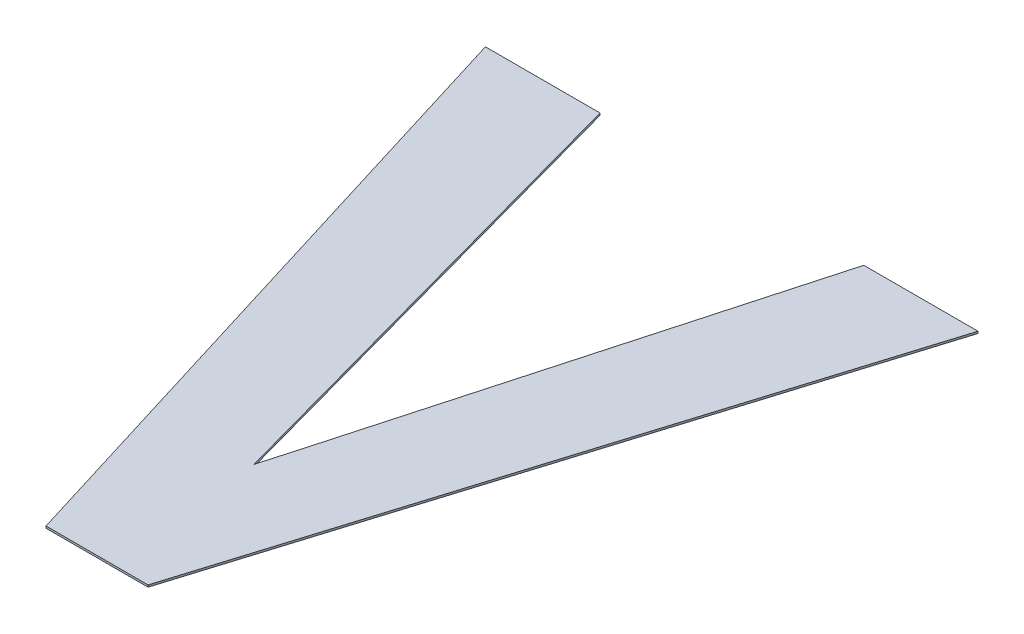
ISO-10303-21;
HEADER;
FILE_DESCRIPTION(('STEP AP214'),'2;1');
FILE_NAME('part.step','',(''),(''),'','','');
FILE_SCHEMA(('AUTOMOTIVE_DESIGN { 1 0 10303 214 1 1 1 1 }'));
ENDSEC;
DATA;
#1=APPLICATION_CONTEXT('core data for automotive mechanical design processes');
#2=APPLICATION_PROTOCOL_DEFINITION('international standard','automotive_design',2000,#1);
#3=PRODUCT_CONTEXT('',#1,'mechanical');
#4=PRODUCT('Part','Part','',(#3));
#5=PRODUCT_RELATED_PRODUCT_CATEGORY('part','',(#4));
#6=PRODUCT_DEFINITION_FORMATION('','',#4);
#7=PRODUCT_DEFINITION_CONTEXT('part definition',#1,'design');
#8=PRODUCT_DEFINITION('design','',#6,#7);
#9=PRODUCT_DEFINITION_SHAPE('','',#8);
#10=(LENGTH_UNIT() NAMED_UNIT(*) SI_UNIT(.MILLI.,.METRE.));
#11=(NAMED_UNIT(*) PLANE_ANGLE_UNIT() SI_UNIT($,.RADIAN.));
#12=(NAMED_UNIT(*) SI_UNIT($,.STERADIAN.) SOLID_ANGLE_UNIT());
#13=UNCERTAINTY_MEASURE_WITH_UNIT(LENGTH_MEASURE(1.E-05),#10,'distance_accuracy_value','');
#14=(GEOMETRIC_REPRESENTATION_CONTEXT(3) GLOBAL_UNCERTAINTY_ASSIGNED_CONTEXT((#13)) GLOBAL_UNIT_ASSIGNED_CONTEXT((#10,
#11,#12)) REPRESENTATION_CONTEXT('',''));
#15=CARTESIAN_POINT('',(0.,0.,0.));
#16=DIRECTION('',(0.,0.,1.));
#17=DIRECTION('',(1.,0.,0.));
#18=AXIS2_PLACEMENT_3D('',#15,#16,#17);
#19=CARTESIAN_POINT('',(0.,6.,0.));
#20=DIRECTION('',(0.,1.,0.));
#21=DIRECTION('',(1.,0.,0.));
#22=AXIS2_PLACEMENT_3D('',#19,#20,#21);
#23=PLANE('',#22);
#24=DIRECTION('',(0.294085848837945,0.,0.95577900872182));
#25=VECTOR('',#24,1.);
#26=CARTESIAN_POINT('',(4.393508791849,6.,0.859042110188));
#27=LINE('',#26,#25);
#28=CARTESIAN_POINT('',(4.393508791849,6.,0.859042110188));
#29=VERTEX_POINT('',#28);
#30=CARTESIAN_POINT('',(5.370431868772,6.,4.034042110188));
#31=VERTEX_POINT('',#30);
#32=EDGE_CURVE('E154',#29,#31,#27,.T.);
#33=ORIENTED_EDGE('',*,*,#32,.F.);
#34=DIRECTION('',(-1.,0.,0.));
#35=VECTOR('',#34,1.);
#36=CARTESIAN_POINT('',(4.967257265597,6.,0.859042110188));
#37=LINE('',#36,#35);
#38=CARTESIAN_POINT('',(4.967257265597,6.,0.859042110188));
#39=VERTEX_POINT('',#38);
#40=EDGE_CURVE('E27',#39,#29,#37,.T.);
#41=ORIENTED_EDGE('',*,*,#40,.F.);
#42=DIRECTION('',(-0.265011551126037,0.,-0.964245237359134));
#43=VECTOR('',#42,1.);
#44=CARTESIAN_POINT('',(5.571373057213,6.,3.057119033265));
#45=LINE('',#44,#43);
#46=CARTESIAN_POINT('',(5.571373057213,6.,3.057119033265));
#47=VERTEX_POINT('',#46);
#48=EDGE_CURVE('E170',#47,#39,#45,.T.);
#49=ORIENTED_EDGE('',*,*,#48,.F.);
#50=DIRECTION('',(-0.265613747619887,0.,-0.96407952839759));
#51=VECTOR('',#50,1.);
#52=CARTESIAN_POINT('',(5.623708222048,6.,3.247076298223));
#53=LINE('',#52,#51);
#54=CARTESIAN_POINT('',(5.623708222048,6.,3.247076298223));
#55=VERTEX_POINT('',#54);
#56=EDGE_CURVE('E113',#55,#47,#53,.T.);
#57=ORIENTED_EDGE('',*,*,#56,.F.);
#58=DIRECTION('',(-0.272152670482986,0.,0.96225408492195));
#59=VECTOR('',#58,1.);
#60=CARTESIAN_POINT('',(5.677981726322,6.,3.055180693827));
#61=LINE('',#60,#59);
#62=CARTESIAN_POINT('',(5.677981726322,6.,3.055180693827));
#63=VERTEX_POINT('',#62);
#64=EDGE_CURVE('E105',#63,#55,#61,.T.);
#65=ORIENTED_EDGE('',*,*,#64,.F.);
#66=DIRECTION('',(-0.267073532320139,0.,0.9636761532455));
#67=VECTOR('',#66,1.);
#68=CARTESIAN_POINT('',(6.28662030996,6.,0.859042110188));
#69=LINE('',#68,#67);
#70=CARTESIAN_POINT('',(6.28662030996,6.,0.859042110188));
#71=VERTEX_POINT('',#70);
#72=EDGE_CURVE('E109',#71,#63,#69,.T.);
#73=ORIENTED_EDGE('',*,*,#72,.F.);
#74=DIRECTION('',(-1.,0.,0.));
#75=VECTOR('',#74,1.);
#76=CARTESIAN_POINT('',(6.857784331124,6.,0.859042110188));
#77=LINE('',#76,#75);
#78=CARTESIAN_POINT('',(6.857784331124,6.,0.859042110188));
#79=VERTEX_POINT('',#78);
#80=EDGE_CURVE('E162',#79,#71,#77,.T.);
#81=ORIENTED_EDGE('',*,*,#80,.F.);
#82=DIRECTION('',(0.294085848837945,0.,-0.95577900872182));
#83=VECTOR('',#82,1.);
#84=CARTESIAN_POINT('',(5.880861254201,6.,4.034042110188));
#85=LINE('',#84,#83);
#86=CARTESIAN_POINT('',(5.880861254201,6.,4.034042110188));
#87=VERTEX_POINT('',#86);
#88=EDGE_CURVE('E174',#87,#79,#85,.T.);
#89=ORIENTED_EDGE('',*,*,#88,.F.);
#90=DIRECTION('',(1.,0.,0.));
#91=VECTOR('',#90,1.);
#92=CARTESIAN_POINT('',(5.370431868772,6.,4.034042110188));
#93=LINE('',#92,#91);
#94=EDGE_CURVE('E148',#31,#87,#93,.T.);
#95=ORIENTED_EDGE('',*,*,#94,.F.);
#96=EDGE_LOOP('',(#33,#41,#49,#57,#65,#73,#81,#89,#95));
#97=FACE_BOUND('',#96,.T.);
#98=ADVANCED_FACE('F16',(#97),#23,.F.);
#99=CARTESIAN_POINT('',(0.,6.01,0.));
#100=DIRECTION('',(0.,1.,0.));
#101=DIRECTION('',(1.,0.,0.));
#102=AXIS2_PLACEMENT_3D('',#99,#100,#101);
#103=PLANE('',#102);
#104=DIRECTION('',(0.294085848837945,0.,0.95577900872182));
#105=VECTOR('',#104,1.);
#106=CARTESIAN_POINT('',(4.393508791849,6.01,0.859042110188));
#107=LINE('',#106,#105);
#108=CARTESIAN_POINT('',(4.393508791849,6.01,0.859042110188));
#109=VERTEX_POINT('',#108);
#110=CARTESIAN_POINT('',(5.370431868772,6.01,4.034042110188));
#111=VERTEX_POINT('',#110);
#112=EDGE_CURVE('E149',#109,#111,#107,.T.);
#113=ORIENTED_EDGE('',*,*,#112,.T.);
#114=DIRECTION('',(1.,0.,0.));
#115=VECTOR('',#114,1.);
#116=CARTESIAN_POINT('',(5.370431868772,6.01,4.034042110188));
#117=LINE('',#116,#115);
#118=CARTESIAN_POINT('',(5.880861254201,6.01,4.034042110188));
#119=VERTEX_POINT('',#118);
#120=EDGE_CURVE('E159',#111,#119,#117,.T.);
#121=ORIENTED_EDGE('',*,*,#120,.T.);
#122=DIRECTION('',(0.294085848837945,0.,-0.95577900872182));
#123=VECTOR('',#122,1.);
#124=CARTESIAN_POINT('',(5.880861254201,6.01,4.034042110188));
#125=LINE('',#124,#123);
#126=CARTESIAN_POINT('',(6.857784331124,6.01,0.859042110188));
#127=VERTEX_POINT('',#126);
#128=EDGE_CURVE('E165',#119,#127,#125,.T.);
#129=ORIENTED_EDGE('',*,*,#128,.T.);
#130=DIRECTION('',(-1.,0.,0.));
#131=VECTOR('',#130,1.);
#132=CARTESIAN_POINT('',(6.857784331124,6.01,0.859042110188));
#133=LINE('',#132,#131);
#134=CARTESIAN_POINT('',(6.28662030996,6.01,0.859042110188));
#135=VERTEX_POINT('',#134);
#136=EDGE_CURVE('E134',#127,#135,#133,.T.);
#137=ORIENTED_EDGE('',*,*,#136,.T.);
#138=DIRECTION('',(-0.267073532320139,0.,0.9636761532455));
#139=VECTOR('',#138,1.);
#140=CARTESIAN_POINT('',(6.28662030996,6.01,0.859042110188));
#141=LINE('',#140,#139);
#142=CARTESIAN_POINT('',(5.677981726322,6.01,3.055180693827));
#143=VERTEX_POINT('',#142);
#144=EDGE_CURVE('E20',#135,#143,#141,.T.);
#145=ORIENTED_EDGE('',*,*,#144,.T.);
#146=DIRECTION('',(-0.272152670482986,0.,0.96225408492195));
#147=VECTOR('',#146,1.);
#148=CARTESIAN_POINT('',(5.677981726322,6.01,3.055180693827));
#149=LINE('',#148,#147);
#150=CARTESIAN_POINT('',(5.623708222048,6.01,3.247076298223));
#151=VERTEX_POINT('',#150);
#152=EDGE_CURVE('E124',#143,#151,#149,.T.);
#153=ORIENTED_EDGE('',*,*,#152,.T.);
#154=DIRECTION('',(-0.265613747619887,0.,-0.96407952839759));
#155=VECTOR('',#154,1.);
#156=CARTESIAN_POINT('',(5.623708222048,6.01,3.247076298223));
#157=LINE('',#156,#155);
#158=CARTESIAN_POINT('',(5.571373057213,6.01,3.057119033265));
#159=VERTEX_POINT('',#158);
#160=EDGE_CURVE('E166',#151,#159,#157,.T.);
#161=ORIENTED_EDGE('',*,*,#160,.T.);
#162=DIRECTION('',(-0.265011551126037,0.,-0.964245237359134));
#163=VECTOR('',#162,1.);
#164=CARTESIAN_POINT('',(5.571373057213,6.01,3.057119033265));
#165=LINE('',#164,#163);
#166=CARTESIAN_POINT('',(4.967257265597,6.01,0.859042110188));
#167=VERTEX_POINT('',#166);
#168=EDGE_CURVE('E144',#159,#167,#165,.T.);
#169=ORIENTED_EDGE('',*,*,#168,.T.);
#170=DIRECTION('',(-1.,0.,0.));
#171=VECTOR('',#170,1.);
#172=CARTESIAN_POINT('',(4.967257265597,6.01,0.859042110188));
#173=LINE('',#172,#171);
#174=EDGE_CURVE('E11',#167,#109,#173,.T.);
#175=ORIENTED_EDGE('',*,*,#174,.T.);
#176=EDGE_LOOP('',(#113,#121,#129,#137,#145,#153,#161,#169,#175));
#177=FACE_BOUND('',#176,.T.);
#178=ADVANCED_FACE('F18',(#177),#103,.T.);
#179=CARTESIAN_POINT('',(4.967257265597,6.01,0.859042110188));
#180=DIRECTION('',(0.,0.,1.));
#181=DIRECTION('',(1.,0.,0.));
#182=AXIS2_PLACEMENT_3D('',#179,#180,#181);
#183=PLANE('',#182);
#184=ORIENTED_EDGE('',*,*,#40,.T.);
#185=DIRECTION('',(0.,-1.,0.));
#186=VECTOR('',#185,1.);
#187=CARTESIAN_POINT('',(4.393508791849,6.01,0.859042110188));
#188=LINE('',#187,#186);
#189=EDGE_CURVE('E145',#109,#29,#188,.T.);
#190=ORIENTED_EDGE('',*,*,#189,.F.);
#191=ORIENTED_EDGE('',*,*,#174,.F.);
#192=DIRECTION('',(0.,-1.,0.));
#193=VECTOR('',#192,1.);
#194=CARTESIAN_POINT('',(4.967257265597,6.01,0.859042110188));
#195=LINE('',#194,#193);
#196=EDGE_CURVE('E210',#167,#39,#195,.T.);
#197=ORIENTED_EDGE('',*,*,#196,.T.);
#198=EDGE_LOOP('',(#184,#190,#191,#197));
#199=FACE_BOUND('',#198,.T.);
#200=ADVANCED_FACE('F248',(#199),#183,.F.);
#201=CARTESIAN_POINT('',(5.571373057213,6.01,3.057119033265));
#202=DIRECTION('',(-0.964245237359134,0.,0.265011551126037));
#203=DIRECTION('',(0.,1.,0.));
#204=AXIS2_PLACEMENT_3D('',#201,#202,#203);
#205=PLANE('',#204);
#206=ORIENTED_EDGE('',*,*,#48,.T.);
#207=ORIENTED_EDGE('',*,*,#196,.F.);
#208=ORIENTED_EDGE('',*,*,#168,.F.);
#209=DIRECTION('',(0.,-1.,0.));
#210=VECTOR('',#209,1.);
#211=CARTESIAN_POINT('',(5.571373057213,6.01,3.057119033265));
#212=LINE('',#211,#210);
#213=EDGE_CURVE('E171',#159,#47,#212,.T.);
#214=ORIENTED_EDGE('',*,*,#213,.T.);
#215=EDGE_LOOP('',(#206,#207,#208,#214));
#216=FACE_BOUND('',#215,.T.);
#217=ADVANCED_FACE('F251',(#216),#205,.F.);
#218=CARTESIAN_POINT('',(5.623708222048,6.01,3.247076298223));
#219=DIRECTION('',(-0.96407952839759,0.,0.265613747619887));
#220=DIRECTION('',(0.,1.,0.));
#221=AXIS2_PLACEMENT_3D('',#218,#219,#220);
#222=PLANE('',#221);
#223=ORIENTED_EDGE('',*,*,#56,.T.);
#224=ORIENTED_EDGE('',*,*,#213,.F.);
#225=ORIENTED_EDGE('',*,*,#160,.F.);
#226=DIRECTION('',(0.,-1.,0.));
#227=VECTOR('',#226,1.);
#228=CARTESIAN_POINT('',(5.623708222048,6.01,3.247076298223));
#229=LINE('',#228,#227);
#230=EDGE_CURVE('E118',#151,#55,#229,.T.);
#231=ORIENTED_EDGE('',*,*,#230,.T.);
#232=EDGE_LOOP('',(#223,#224,#225,#231));
#233=FACE_BOUND('',#232,.T.);
#234=ADVANCED_FACE('F307',(#233),#222,.F.);
#235=CARTESIAN_POINT('',(5.677981726322,6.01,3.055180693827));
#236=DIRECTION('',(0.96225408492195,0.,0.272152670482986));
#237=DIRECTION('',(0.,-1.,0.));
#238=AXIS2_PLACEMENT_3D('',#235,#236,#237);
#239=PLANE('',#238);
#240=ORIENTED_EDGE('',*,*,#64,.T.);
#241=ORIENTED_EDGE('',*,*,#230,.F.);
#242=ORIENTED_EDGE('',*,*,#152,.F.);
#243=DIRECTION('',(0.,-1.,0.));
#244=VECTOR('',#243,1.);
#245=CARTESIAN_POINT('',(5.677981726322,6.01,3.055180693827));
#246=LINE('',#245,#244);
#247=EDGE_CURVE('E121',#143,#63,#246,.T.);
#248=ORIENTED_EDGE('',*,*,#247,.T.);
#249=EDGE_LOOP('',(#240,#241,#242,#248));
#250=FACE_BOUND('',#249,.T.);
#251=ADVANCED_FACE('F122',(#250),#239,.F.);
#252=CARTESIAN_POINT('',(6.28662030996,6.01,0.859042110188));
#253=DIRECTION('',(0.9636761532455,0.,0.267073532320139));
#254=DIRECTION('',(0.,-1.,0.));
#255=AXIS2_PLACEMENT_3D('',#252,#253,#254);
#256=PLANE('',#255);
#257=ORIENTED_EDGE('',*,*,#72,.T.);
#258=ORIENTED_EDGE('',*,*,#247,.F.);
#259=ORIENTED_EDGE('',*,*,#144,.F.);
#260=DIRECTION('',(0.,-1.,0.));
#261=VECTOR('',#260,1.);
#262=CARTESIAN_POINT('',(6.28662030996,6.01,0.859042110188));
#263=LINE('',#262,#261);
#264=EDGE_CURVE('E131',#135,#71,#263,.T.);
#265=ORIENTED_EDGE('',*,*,#264,.T.);
#266=EDGE_LOOP('',(#257,#258,#259,#265));
#267=FACE_BOUND('',#266,.T.);
#268=ADVANCED_FACE('F129',(#267),#256,.F.);
#269=CARTESIAN_POINT('',(6.857784331124,6.01,0.859042110188));
#270=DIRECTION('',(0.,0.,1.));
#271=DIRECTION('',(1.,0.,0.));
#272=AXIS2_PLACEMENT_3D('',#269,#270,#271);
#273=PLANE('',#272);
#274=ORIENTED_EDGE('',*,*,#80,.T.);
#275=ORIENTED_EDGE('',*,*,#264,.F.);
#276=ORIENTED_EDGE('',*,*,#136,.F.);
#277=DIRECTION('',(0.,-1.,0.));
#278=VECTOR('',#277,1.);
#279=CARTESIAN_POINT('',(6.857784331124,6.01,0.859042110188));
#280=LINE('',#279,#278);
#281=EDGE_CURVE('E177',#127,#79,#280,.T.);
#282=ORIENTED_EDGE('',*,*,#281,.T.);
#283=EDGE_LOOP('',(#274,#275,#276,#282));
#284=FACE_BOUND('',#283,.T.);
#285=ADVANCED_FACE('F230',(#284),#273,.F.);
#286=CARTESIAN_POINT('',(5.880861254201,6.01,4.034042110188));
#287=DIRECTION('',(-0.95577900872182,0.,-0.294085848837945));
#288=DIRECTION('',(-0.294085848837945,0.,0.95577900872182));
#289=AXIS2_PLACEMENT_3D('',#286,#287,#288);
#290=PLANE('',#289);
#291=ORIENTED_EDGE('',*,*,#88,.T.);
#292=ORIENTED_EDGE('',*,*,#281,.F.);
#293=ORIENTED_EDGE('',*,*,#128,.F.);
#294=DIRECTION('',(0.,-1.,0.));
#295=VECTOR('',#294,1.);
#296=CARTESIAN_POINT('',(5.880861254201,6.01,4.034042110188));
#297=LINE('',#296,#295);
#298=EDGE_CURVE('E155',#119,#87,#297,.T.);
#299=ORIENTED_EDGE('',*,*,#298,.T.);
#300=EDGE_LOOP('',(#291,#292,#293,#299));
#301=FACE_BOUND('',#300,.T.);
#302=ADVANCED_FACE('F228',(#301),#290,.F.);
#303=CARTESIAN_POINT('',(5.370431868772,6.01,4.034042110188));
#304=DIRECTION('',(0.,0.,-1.));
#305=DIRECTION('',(0.,-1.,0.));
#306=AXIS2_PLACEMENT_3D('',#303,#304,#305);
#307=PLANE('',#306);
#308=ORIENTED_EDGE('',*,*,#94,.T.);
#309=ORIENTED_EDGE('',*,*,#298,.F.);
#310=ORIENTED_EDGE('',*,*,#120,.F.);
#311=DIRECTION('',(0.,-1.,0.));
#312=VECTOR('',#311,1.);
#313=CARTESIAN_POINT('',(5.370431868772,6.01,4.034042110188));
#314=LINE('',#313,#312);
#315=EDGE_CURVE('E150',#111,#31,#314,.T.);
#316=ORIENTED_EDGE('',*,*,#315,.T.);
#317=EDGE_LOOP('',(#308,#309,#310,#316));
#318=FACE_BOUND('',#317,.T.);
#319=ADVANCED_FACE('F194',(#318),#307,.F.);
#320=CARTESIAN_POINT('',(4.393508791849,6.01,0.859042110188));
#321=DIRECTION('',(0.95577900872182,0.,-0.294085848837945));
#322=DIRECTION('',(0.,-1.,0.));
#323=AXIS2_PLACEMENT_3D('',#320,#321,#322);
#324=PLANE('',#323);
#325=ORIENTED_EDGE('',*,*,#32,.T.);
#326=ORIENTED_EDGE('',*,*,#315,.F.);
#327=ORIENTED_EDGE('',*,*,#112,.F.);
#328=ORIENTED_EDGE('',*,*,#189,.T.);
#329=EDGE_LOOP('',(#325,#326,#327,#328));
#330=FACE_BOUND('',#329,.T.);
#331=ADVANCED_FACE('F187',(#330),#324,.F.);
#332=CLOSED_SHELL('',(#98,#178,#200,#217,#234,#251,#268,#285,#302,#319,#331));
#333=MANIFOLD_SOLID_BREP('B1',#332);
#334=ADVANCED_BREP_SHAPE_REPRESENTATION('',(#18,#333),#14);
#335=SHAPE_DEFINITION_REPRESENTATION(#9,#334);
ENDSEC;
END-ISO-10303-21;
